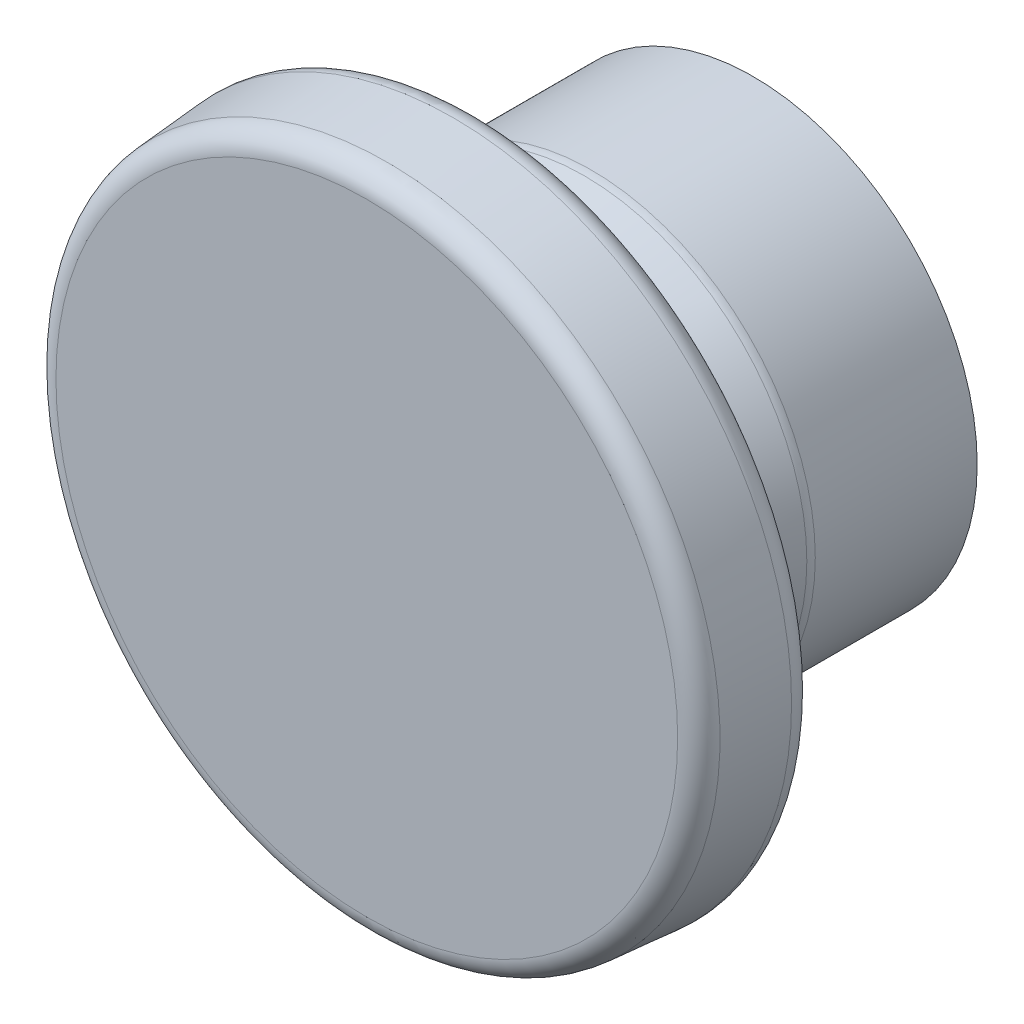
ISO-10303-21;
HEADER;
FILE_DESCRIPTION(('STEP AP214'),'2;1');
FILE_NAME('part.step','',(''),(''),'','','');
FILE_SCHEMA(('AUTOMOTIVE_DESIGN { 1 0 10303 214 1 1 1 1 }'));
ENDSEC;
DATA;
#1=APPLICATION_CONTEXT('core data for automotive mechanical design processes');
#2=APPLICATION_PROTOCOL_DEFINITION('international standard','automotive_design',2000,#1);
#3=PRODUCT_CONTEXT('',#1,'mechanical');
#4=PRODUCT('Part','Part','',(#3));
#5=PRODUCT_RELATED_PRODUCT_CATEGORY('part','',(#4));
#6=PRODUCT_DEFINITION_FORMATION('','',#4);
#7=PRODUCT_DEFINITION_CONTEXT('part definition',#1,'design');
#8=PRODUCT_DEFINITION('design','',#6,#7);
#9=PRODUCT_DEFINITION_SHAPE('','',#8);
#10=(LENGTH_UNIT() NAMED_UNIT(*) SI_UNIT(.MILLI.,.METRE.));
#11=(NAMED_UNIT(*) PLANE_ANGLE_UNIT() SI_UNIT($,.RADIAN.));
#12=(NAMED_UNIT(*) SI_UNIT($,.STERADIAN.) SOLID_ANGLE_UNIT());
#13=UNCERTAINTY_MEASURE_WITH_UNIT(LENGTH_MEASURE(1.E-05),#10,'distance_accuracy_value','');
#14=(GEOMETRIC_REPRESENTATION_CONTEXT(3) GLOBAL_UNCERTAINTY_ASSIGNED_CONTEXT((#13)) GLOBAL_UNIT_ASSIGNED_CONTEXT((#10,
#11,#12)) REPRESENTATION_CONTEXT('',''));
#15=CARTESIAN_POINT('',(0.,0.,0.));
#16=DIRECTION('',(0.,0.,1.));
#17=DIRECTION('',(1.,0.,0.));
#18=AXIS2_PLACEMENT_3D('',#15,#16,#17);
#19=CARTESIAN_POINT('',(-6.4389,0.,0.));
#20=DIRECTION('',(0.,0.,1.));
#21=DIRECTION('',(1.,0.,0.));
#22=AXIS2_PLACEMENT_3D('',#19,#20,#21);
#23=PLANE('',#22);
#24=CARTESIAN_POINT('',(0.,0.,0.));
#25=DIRECTION('',(0.,0.,1.));
#26=DIRECTION('',(1.,0.,0.));
#27=AXIS2_PLACEMENT_3D('',#24,#25,#26);
#28=CIRCLE('',#27,12.8778);
#29=CARTESIAN_POINT('',(12.8778,0.,0.));
#30=VERTEX_POINT('',#29);
#31=EDGE_CURVE('E15',#30,#30,#28,.T.);
#32=ORIENTED_EDGE('',*,*,#31,.F.);
#33=EDGE_LOOP('',(#32));
#34=FACE_BOUND('',#33,.T.);
#35=ADVANCED_FACE('F12',(#34),#23,.F.);
#36=CARTESIAN_POINT('',(0.,0.,11.1125));
#37=DIRECTION('',(0.,0.,1.));
#38=DIRECTION('',(1.,0.,0.));
#39=AXIS2_PLACEMENT_3D('',#36,#37,#38);
#40=CYLINDRICAL_SURFACE('',#39,12.8778);
#41=ORIENTED_EDGE('',*,*,#31,.T.);
#42=EDGE_LOOP('',(#41));
#43=FACE_BOUND('',#42,.T.);
#44=CARTESIAN_POINT('',(0.,0.,9.31062488196954));
#45=DIRECTION('',(0.,0.,1.));
#46=DIRECTION('',(1.,0.,0.));
#47=AXIS2_PLACEMENT_3D('',#44,#45,#46);
#48=CIRCLE('',#47,12.8778);
#49=CARTESIAN_POINT('',(12.8778,0.,9.31062488196954));
#50=VERTEX_POINT('',#49);
#51=EDGE_CURVE('E99',#50,#50,#48,.T.);
#52=ORIENTED_EDGE('',*,*,#51,.F.);
#53=EDGE_LOOP('',(#52));
#54=FACE_BOUND('',#53,.T.);
#55=ADVANCED_FACE('F110',(#43,#54),#40,.T.);
#56=CARTESIAN_POINT('',(0.,0.,9.31062488196954));
#57=DIRECTION('',(0.,0.,1.));
#58=DIRECTION('',(1.,0.,0.));
#59=AXIS2_PLACEMENT_3D('',#56,#57,#58);
#60=TOROIDAL_SURFACE('',#59,11.6078,1.27);
#61=ORIENTED_EDGE('',*,*,#51,.T.);
#62=EDGE_LOOP('',(#61));
#63=FACE_BOUND('',#62,.T.);
#64=CARTESIAN_POINT('',(0.,0.,9.72749709240072));
#65=DIRECTION('',(0.,0.,-1.));
#66=DIRECTION('',(-1.,0.,0.));
#67=AXIS2_PLACEMENT_3D('',#64,#65,#66);
#68=CIRCLE('',#67,12.8074322602336);
#69=CARTESIAN_POINT('',(-12.8074322602336,0.,9.72749709240072));
#70=VERTEX_POINT('',#69);
#71=EDGE_CURVE('E94',#70,#70,#68,.F.);
#72=ORIENTED_EDGE('',*,*,#71,.F.);
#73=EDGE_LOOP('',(#72));
#74=FACE_BOUND('',#73,.T.);
#75=ADVANCED_FACE('F106',(#63,#74),#60,.T.);
#76=CARTESIAN_POINT('',(0.,0.,9.72749709240072));
#77=DIRECTION('',(0.,0.,-1.));
#78=DIRECTION('',(-1.,0.,0.));
#79=AXIS2_PLACEMENT_3D('',#76,#77,#78);
#80=CONICAL_SURFACE('',#79,12.8074322602336,0.3344459141);
#81=CARTESIAN_POINT('',(0.,0.,14.605));
#82=DIRECTION('',(0.,0.,1.));
#83=DIRECTION('',(1.,0.,0.));
#84=AXIS2_PLACEMENT_3D('',#81,#82,#83);
#85=CIRCLE('',#84,11.1125);
#86=CARTESIAN_POINT('',(11.1125,0.,14.605));
#87=VERTEX_POINT('',#86);
#88=EDGE_CURVE('E85',#87,#87,#85,.T.);
#89=ORIENTED_EDGE('',*,*,#88,.F.);
#90=EDGE_LOOP('',(#89));
#91=FACE_BOUND('',#90,.T.);
#92=ORIENTED_EDGE('',*,*,#71,.T.);
#93=EDGE_LOOP('',(#92));
#94=FACE_BOUND('',#93,.T.);
#95=ADVANCED_FACE('F109',(#91,#94),#80,.T.);
#96=CARTESIAN_POINT('',(0.,0.,11.1125));
#97=DIRECTION('',(0.,0.,1.));
#98=DIRECTION('',(1.,0.,0.));
#99=AXIS2_PLACEMENT_3D('',#96,#97,#98);
#100=CYLINDRICAL_SURFACE('',#99,11.1125);
#101=CARTESIAN_POINT('',(0.,0.,15.875));
#102=DIRECTION('',(0.,0.,1.));
#103=DIRECTION('',(1.,0.,0.));
#104=AXIS2_PLACEMENT_3D('',#101,#102,#103);
#105=CIRCLE('',#104,11.1125);
#106=CARTESIAN_POINT('',(11.1125,0.,15.875));
#107=VERTEX_POINT('',#106);
#108=EDGE_CURVE('E93',#107,#107,#105,.F.);
#109=ORIENTED_EDGE('',*,*,#108,.T.);
#110=EDGE_LOOP('',(#109));
#111=FACE_BOUND('',#110,.T.);
#112=ORIENTED_EDGE('',*,*,#88,.T.);
#113=EDGE_LOOP('',(#112));
#114=FACE_BOUND('',#113,.T.);
#115=ADVANCED_FACE('F158',(#111,#114),#100,.T.);
#116=CARTESIAN_POINT('',(-15.33525,0.,15.875));
#117=DIRECTION('',(0.,0.,1.));
#118=DIRECTION('',(1.,0.,0.));
#119=AXIS2_PLACEMENT_3D('',#116,#117,#118);
#120=PLANE('',#119);
#121=ORIENTED_EDGE('',*,*,#108,.F.);
#122=EDGE_LOOP('',(#121));
#123=FACE_BOUND('',#122,.T.);
#124=CARTESIAN_POINT('',(0.,0.,15.875));
#125=DIRECTION('',(0.,0.,1.));
#126=DIRECTION('',(1.,0.,0.));
#127=AXIS2_PLACEMENT_3D('',#124,#125,#126);
#128=CIRCLE('',#127,18.1823424816752);
#129=CARTESIAN_POINT('',(18.1823424816752,0.,15.875));
#130=VERTEX_POINT('',#129);
#131=EDGE_CURVE('E29',#130,#130,#128,.T.);
#132=ORIENTED_EDGE('',*,*,#131,.F.);
#133=EDGE_LOOP('',(#132));
#134=FACE_BOUND('',#133,.T.);
#135=ADVANCED_FACE('F62',(#123,#134),#120,.F.);
#136=CARTESIAN_POINT('',(0.,0.,17.145));
#137=DIRECTION('',(0.,0.,1.));
#138=DIRECTION('',(1.,0.,0.));
#139=AXIS2_PLACEMENT_3D('',#136,#137,#138);
#140=TOROIDAL_SURFACE('',#139,18.1823425,1.27);
#141=ORIENTED_EDGE('',*,*,#131,.T.);
#142=EDGE_LOOP('',(#141));
#143=FACE_BOUND('',#142,.T.);
#144=CARTESIAN_POINT('',(0.,0.,17.2462764322943));
#145=DIRECTION('',(0.,0.,-1.));
#146=DIRECTION('',(-1.,0.,0.));
#147=AXIS2_PLACEMENT_3D('',#144,#145,#146);
#148=CIRCLE('',#147,19.4482978853551);
#149=CARTESIAN_POINT('',(-19.4482978853551,0.,17.2462764322943));
#150=VERTEX_POINT('',#149);
#151=EDGE_CURVE('E24',#150,#150,#148,.F.);
#152=ORIENTED_EDGE('',*,*,#151,.F.);
#153=EDGE_LOOP('',(#152));
#154=FACE_BOUND('',#153,.T.);
#155=ADVANCED_FACE('F56',(#143,#154),#140,.T.);
#156=CARTESIAN_POINT('',(0.,0.,17.2462764322944));
#157=DIRECTION('',(0.,0.,-1.));
#158=DIRECTION('',(-1.,0.,0.));
#159=AXIS2_PLACEMENT_3D('',#156,#157,#158);
#160=CONICAL_SURFACE('',#159,19.4482978853551,0.0798299857000003);
#161=ORIENTED_EDGE('',*,*,#151,.T.);
#162=EDGE_LOOP('',(#161));
#163=FACE_BOUND('',#162,.T.);
#164=CARTESIAN_POINT('',(0.,0.,21.056276433756));
#165=DIRECTION('',(0.,0.,-1.));
#166=DIRECTION('',(-1.,0.,0.));
#167=AXIS2_PLACEMENT_3D('',#164,#165,#166);
#168=CIRCLE('',#167,19.1434979036243);
#169=CARTESIAN_POINT('',(-19.1434979036243,0.,21.056276433756));
#170=VERTEX_POINT('',#169);
#171=EDGE_CURVE('E19',#170,#170,#168,.F.);
#172=ORIENTED_EDGE('',*,*,#171,.F.);
#173=EDGE_LOOP('',(#172));
#174=FACE_BOUND('',#173,.T.);
#175=ADVANCED_FACE('F52',(#163,#174),#160,.T.);
#176=CARTESIAN_POINT('',(0.,0.,20.955));
#177=DIRECTION('',(0.,0.,-1.));
#178=DIRECTION('',(-1.,0.,0.));
#179=AXIS2_PLACEMENT_3D('',#176,#177,#178);
#180=TOROIDAL_SURFACE('',#179,17.8775425,1.27);
#181=ORIENTED_EDGE('',*,*,#171,.T.);
#182=EDGE_LOOP('',(#181));
#183=FACE_BOUND('',#182,.T.);
#184=CARTESIAN_POINT('',(0.,0.,22.225));
#185=DIRECTION('',(0.,0.,-1.));
#186=DIRECTION('',(-1.,0.,0.));
#187=AXIS2_PLACEMENT_3D('',#184,#185,#186);
#188=CIRCLE('',#187,17.8775424816752);
#189=CARTESIAN_POINT('',(-17.8775424816752,0.,22.225));
#190=VERTEX_POINT('',#189);
#191=EDGE_CURVE('E8',#190,#190,#188,.T.);
#192=ORIENTED_EDGE('',*,*,#191,.T.);
#193=EDGE_LOOP('',(#192));
#194=FACE_BOUND('',#193,.T.);
#195=ADVANCED_FACE('F41',(#183,#194),#180,.T.);
#196=CARTESIAN_POINT('',(-9.525,0.,22.225));
#197=DIRECTION('',(0.,0.,-1.));
#198=DIRECTION('',(-1.,0.,0.));
#199=AXIS2_PLACEMENT_3D('',#196,#197,#198);
#200=PLANE('',#199);
#201=ORIENTED_EDGE('',*,*,#191,.F.);
#202=EDGE_LOOP('',(#201));
#203=FACE_BOUND('',#202,.T.);
#204=ADVANCED_FACE('F51',(#203),#200,.F.);
#205=CLOSED_SHELL('',(#35,#55,#75,#95,#115,#135,#155,#175,#195,#204));
#206=MANIFOLD_SOLID_BREP('B1',#205);
#207=ADVANCED_BREP_SHAPE_REPRESENTATION('',(#18,#206),#14);
#208=SHAPE_DEFINITION_REPRESENTATION(#9,#207);
ENDSEC;
END-ISO-10303-21;
